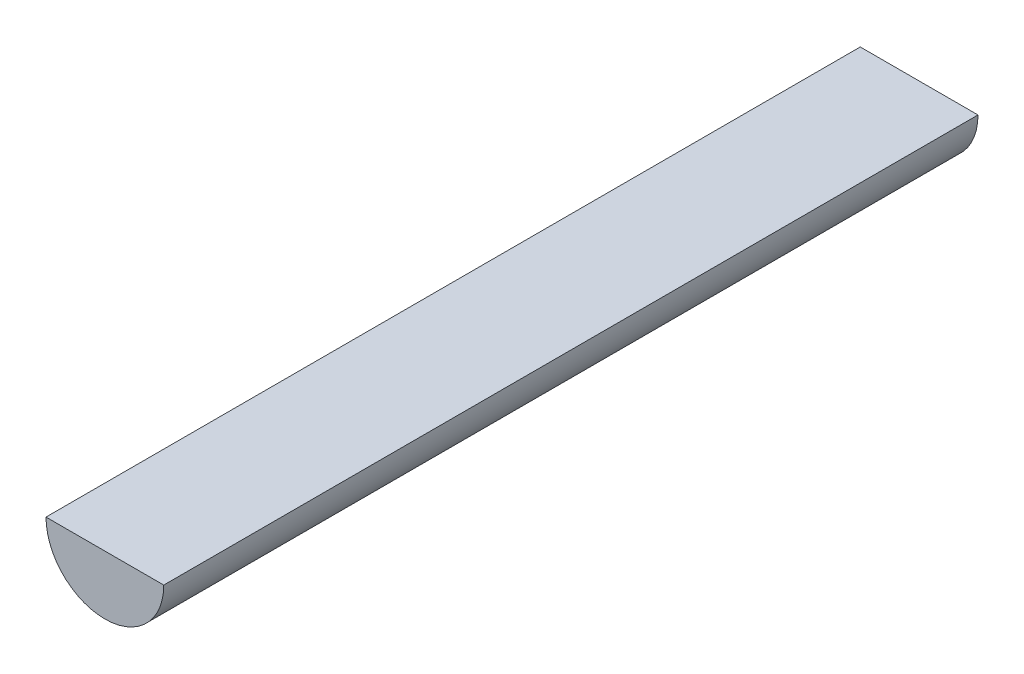
ISO-10303-21;
HEADER;
FILE_DESCRIPTION(('STEP AP214'),'2;1');
FILE_NAME('part.step','',(''),(''),'','','');
FILE_SCHEMA(('AUTOMOTIVE_DESIGN { 1 0 10303 214 1 1 1 1 }'));
ENDSEC;
DATA;
#1=APPLICATION_CONTEXT('core data for automotive mechanical design processes');
#2=APPLICATION_PROTOCOL_DEFINITION('international standard','automotive_design',2000,#1);
#3=PRODUCT_CONTEXT('',#1,'mechanical');
#4=PRODUCT('Part','Part','',(#3));
#5=PRODUCT_RELATED_PRODUCT_CATEGORY('part','',(#4));
#6=PRODUCT_DEFINITION_FORMATION('','',#4);
#7=PRODUCT_DEFINITION_CONTEXT('part definition',#1,'design');
#8=PRODUCT_DEFINITION('design','',#6,#7);
#9=PRODUCT_DEFINITION_SHAPE('','',#8);
#10=(LENGTH_UNIT() NAMED_UNIT(*) SI_UNIT(.MILLI.,.METRE.));
#11=(NAMED_UNIT(*) PLANE_ANGLE_UNIT() SI_UNIT($,.RADIAN.));
#12=(NAMED_UNIT(*) SI_UNIT($,.STERADIAN.) SOLID_ANGLE_UNIT());
#13=UNCERTAINTY_MEASURE_WITH_UNIT(LENGTH_MEASURE(1.E-05),#10,'distance_accuracy_value','');
#14=(GEOMETRIC_REPRESENTATION_CONTEXT(3) GLOBAL_UNCERTAINTY_ASSIGNED_CONTEXT((#13)) GLOBAL_UNIT_ASSIGNED_CONTEXT((#10,
#11,#12)) REPRESENTATION_CONTEXT('',''));
#15=CARTESIAN_POINT('',(0.,0.,0.));
#16=DIRECTION('',(0.,0.,1.));
#17=DIRECTION('',(1.,0.,0.));
#18=AXIS2_PLACEMENT_3D('',#15,#16,#17);
#19=CARTESIAN_POINT('',(0.,0.,65.));
#20=DIRECTION('',(0.,0.,-1.));
#21=DIRECTION('',(-1.,0.,0.));
#22=AXIS2_PLACEMENT_3D('',#19,#20,#21);
#23=CYLINDRICAL_SURFACE('',#22,4.7);
#24=CARTESIAN_POINT('',(0.,0.,0.));
#25=DIRECTION('',(0.,0.,1.));
#26=DIRECTION('',(1.,0.,0.));
#27=AXIS2_PLACEMENT_3D('',#24,#25,#26);
#28=CIRCLE('',#27,4.7);
#29=CARTESIAN_POINT('',(-4.7,0.,0.));
#30=VERTEX_POINT('',#29);
#31=CARTESIAN_POINT('',(4.7,0.,0.));
#32=VERTEX_POINT('',#31);
#33=EDGE_CURVE('E76',#30,#32,#28,.T.);
#34=ORIENTED_EDGE('',*,*,#33,.T.);
#35=DIRECTION('',(0.,0.,-1.));
#36=VECTOR('',#35,1.);
#37=CARTESIAN_POINT('',(4.7,0.,65.));
#38=LINE('',#37,#36);
#39=CARTESIAN_POINT('',(4.7,0.,65.));
#40=VERTEX_POINT('',#39);
#41=EDGE_CURVE('E11',#40,#32,#38,.T.);
#42=ORIENTED_EDGE('',*,*,#41,.F.);
#43=CARTESIAN_POINT('',(0.,0.,65.));
#44=DIRECTION('',(0.,0.,1.));
#45=DIRECTION('',(1.,0.,0.));
#46=AXIS2_PLACEMENT_3D('',#43,#44,#45);
#47=CIRCLE('',#46,4.7);
#48=CARTESIAN_POINT('',(-4.7,0.,65.));
#49=VERTEX_POINT('',#48);
#50=EDGE_CURVE('E75',#49,#40,#47,.T.);
#51=ORIENTED_EDGE('',*,*,#50,.F.);
#52=DIRECTION('',(0.,0.,-1.));
#53=VECTOR('',#52,1.);
#54=CARTESIAN_POINT('',(-4.7,0.,65.));
#55=LINE('',#54,#53);
#56=EDGE_CURVE('E52',#49,#30,#55,.T.);
#57=ORIENTED_EDGE('',*,*,#56,.T.);
#58=EDGE_LOOP('',(#34,#42,#51,#57));
#59=FACE_BOUND('',#58,.T.);
#60=ADVANCED_FACE('F43',(#59),#23,.T.);
#61=CARTESIAN_POINT('',(-4.7,0.,65.));
#62=DIRECTION('',(0.,-1.,0.));
#63=DIRECTION('',(0.,0.,-1.));
#64=AXIS2_PLACEMENT_3D('',#61,#62,#63);
#65=PLANE('',#64);
#66=DIRECTION('',(-1.,0.,0.));
#67=VECTOR('',#66,1.);
#68=CARTESIAN_POINT('',(-4.7,0.,0.));
#69=LINE('',#68,#67);
#70=EDGE_CURVE('E67',#32,#30,#69,.T.);
#71=ORIENTED_EDGE('',*,*,#70,.T.);
#72=ORIENTED_EDGE('',*,*,#56,.F.);
#73=DIRECTION('',(-1.,0.,0.));
#74=VECTOR('',#73,1.);
#75=CARTESIAN_POINT('',(-4.7,0.,65.));
#76=LINE('',#75,#74);
#77=EDGE_CURVE('E59',#40,#49,#76,.T.);
#78=ORIENTED_EDGE('',*,*,#77,.F.);
#79=ORIENTED_EDGE('',*,*,#41,.T.);
#80=EDGE_LOOP('',(#71,#72,#78,#79));
#81=FACE_BOUND('',#80,.T.);
#82=ADVANCED_FACE('F70',(#81),#65,.F.);
#83=CARTESIAN_POINT('',(0.,0.,65.));
#84=DIRECTION('',(0.,0.,1.));
#85=DIRECTION('',(1.,0.,0.));
#86=AXIS2_PLACEMENT_3D('',#83,#84,#85);
#87=PLANE('',#86);
#88=ORIENTED_EDGE('',*,*,#50,.T.);
#89=ORIENTED_EDGE('',*,*,#77,.T.);
#90=EDGE_LOOP('',(#88,#89));
#91=FACE_BOUND('',#90,.T.);
#92=ADVANCED_FACE('F87',(#91),#87,.T.);
#93=CARTESIAN_POINT('',(0.,0.,0.));
#94=DIRECTION('',(0.,0.,1.));
#95=DIRECTION('',(1.,0.,0.));
#96=AXIS2_PLACEMENT_3D('',#93,#94,#95);
#97=PLANE('',#96);
#98=ORIENTED_EDGE('',*,*,#33,.F.);
#99=ORIENTED_EDGE('',*,*,#70,.F.);
#100=EDGE_LOOP('',(#98,#99));
#101=FACE_BOUND('',#100,.T.);
#102=ADVANCED_FACE('F80',(#101),#97,.F.);
#103=CLOSED_SHELL('',(#60,#82,#92,#102));
#104=MANIFOLD_SOLID_BREP('B2',#103);
#105=ADVANCED_BREP_SHAPE_REPRESENTATION('',(#18,#104),#14);
#106=SHAPE_DEFINITION_REPRESENTATION(#9,#105);
ENDSEC;
END-ISO-10303-21;
